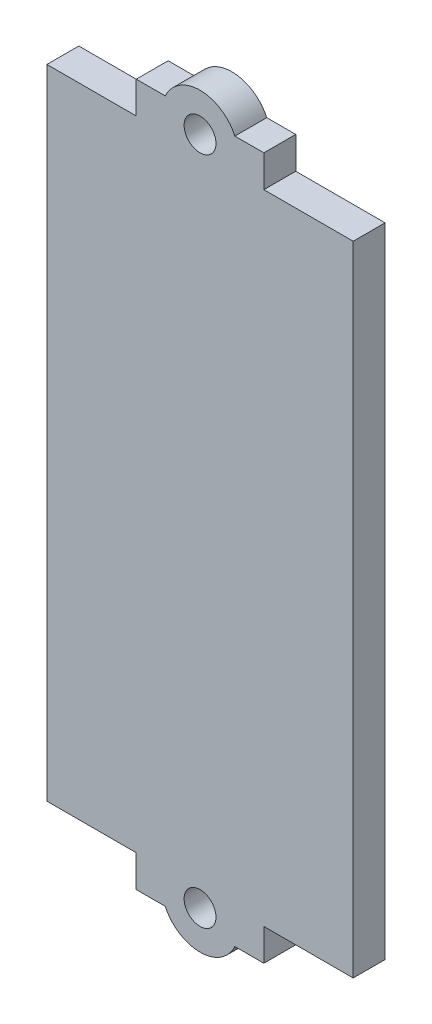
ISO-10303-21;
HEADER;
FILE_DESCRIPTION(('STEP AP214'),'2;1');
FILE_NAME('part.step','',(''),(''),'','','');
FILE_SCHEMA(('AUTOMOTIVE_DESIGN { 1 0 10303 214 1 1 1 1 }'));
ENDSEC;
DATA;
#1=APPLICATION_CONTEXT('core data for automotive mechanical design processes');
#2=APPLICATION_PROTOCOL_DEFINITION('international standard','automotive_design',2000,#1);
#3=PRODUCT_CONTEXT('',#1,'mechanical');
#4=PRODUCT('Part','Part','',(#3));
#5=PRODUCT_RELATED_PRODUCT_CATEGORY('part','',(#4));
#6=PRODUCT_DEFINITION_FORMATION('','',#4);
#7=PRODUCT_DEFINITION_CONTEXT('part definition',#1,'design');
#8=PRODUCT_DEFINITION('design','',#6,#7);
#9=PRODUCT_DEFINITION_SHAPE('','',#8);
#10=(LENGTH_UNIT() NAMED_UNIT(*) SI_UNIT(.MILLI.,.METRE.));
#11=(NAMED_UNIT(*) PLANE_ANGLE_UNIT() SI_UNIT($,.RADIAN.));
#12=(NAMED_UNIT(*) SI_UNIT($,.STERADIAN.) SOLID_ANGLE_UNIT());
#13=UNCERTAINTY_MEASURE_WITH_UNIT(LENGTH_MEASURE(1.E-05),#10,'distance_accuracy_value','');
#14=(GEOMETRIC_REPRESENTATION_CONTEXT(3) GLOBAL_UNCERTAINTY_ASSIGNED_CONTEXT((#13)) GLOBAL_UNIT_ASSIGNED_CONTEXT((#10,
#11,#12)) REPRESENTATION_CONTEXT('',''));
#15=CARTESIAN_POINT('',(0.,0.,0.));
#16=DIRECTION('',(0.,0.,1.));
#17=DIRECTION('',(1.,0.,0.));
#18=AXIS2_PLACEMENT_3D('',#15,#16,#17);
#19=CARTESIAN_POINT('',(0.,-55.,0.));
#20=DIRECTION('',(0.,1.,0.));
#21=DIRECTION('',(0.,0.,-1.));
#22=AXIS2_PLACEMENT_3D('',#19,#20,#21);
#23=PLANE('',#22);
#24=DIRECTION('',(0.,0.,1.));
#25=VECTOR('',#24,1.);
#26=CARTESIAN_POINT('',(-5.45435605731785,-55.,0.));
#27=LINE('',#26,#25);
#28=CARTESIAN_POINT('',(-5.45435605731785,-55.,5.));
#29=VERTEX_POINT('',#28);
#30=CARTESIAN_POINT('',(-5.45435605731785,-55.,0.));
#31=VERTEX_POINT('',#30);
#32=EDGE_CURVE('E11',#29,#31,#27,.F.);
#33=ORIENTED_EDGE('',*,*,#32,.F.);
#34=DIRECTION('',(1.,0.,0.));
#35=VECTOR('',#34,1.);
#36=CARTESIAN_POINT('',(-10.,-55.,5.));
#37=LINE('',#36,#35);
#38=CARTESIAN_POINT('',(-10.,-55.,5.));
#39=VERTEX_POINT('',#38);
#40=EDGE_CURVE('E155',#39,#29,#37,.T.);
#41=ORIENTED_EDGE('',*,*,#40,.F.);
#42=DIRECTION('',(0.,0.,1.));
#43=VECTOR('',#42,1.);
#44=CARTESIAN_POINT('',(-10.,-55.,5.));
#45=LINE('',#44,#43);
#46=CARTESIAN_POINT('',(-10.,-55.,0.));
#47=VERTEX_POINT('',#46);
#48=EDGE_CURVE('E176',#47,#39,#45,.T.);
#49=ORIENTED_EDGE('',*,*,#48,.F.);
#50=DIRECTION('',(-1.,0.,0.));
#51=VECTOR('',#50,1.);
#52=CARTESIAN_POINT('',(-10.,-55.,0.));
#53=LINE('',#52,#51);
#54=EDGE_CURVE('E156',#31,#47,#53,.T.);
#55=ORIENTED_EDGE('',*,*,#54,.F.);
#56=EDGE_LOOP('',(#33,#41,#49,#55));
#57=FACE_BOUND('',#56,.T.);
#58=ADVANCED_FACE('F33',(#57),#23,.F.);
#59=DIRECTION('',(0.,0.,1.));
#60=VECTOR('',#59,1.);
#61=CARTESIAN_POINT('',(5.45435605731786,-55.,0.));
#62=LINE('',#61,#60);
#63=CARTESIAN_POINT('',(5.45435605731786,-55.,0.));
#64=VERTEX_POINT('',#63);
#65=CARTESIAN_POINT('',(5.45435605731786,-55.,5.));
#66=VERTEX_POINT('',#65);
#67=EDGE_CURVE('E41',#64,#66,#62,.T.);
#68=ORIENTED_EDGE('',*,*,#67,.F.);
#69=CARTESIAN_POINT('',(9.99999999999999,-55.,0.));
#70=VERTEX_POINT('',#69);
#71=EDGE_CURVE('E271',#70,#64,#53,.T.);
#72=ORIENTED_EDGE('',*,*,#71,.F.);
#73=DIRECTION('',(0.,0.,-1.));
#74=VECTOR('',#73,1.);
#75=CARTESIAN_POINT('',(9.99999999999999,-55.,5.));
#76=LINE('',#75,#74);
#77=CARTESIAN_POINT('',(9.99999999999999,-55.,5.));
#78=VERTEX_POINT('',#77);
#79=EDGE_CURVE('E166',#78,#70,#76,.T.);
#80=ORIENTED_EDGE('',*,*,#79,.F.);
#81=EDGE_CURVE('E162',#66,#78,#37,.T.);
#82=ORIENTED_EDGE('',*,*,#81,.F.);
#83=EDGE_LOOP('',(#68,#72,#80,#82));
#84=FACE_BOUND('',#83,.T.);
#85=ADVANCED_FACE('F309',(#84),#23,.F.);
#86=CARTESIAN_POINT('',(0.,55.,0.));
#87=DIRECTION('',(0.,-1.,0.));
#88=DIRECTION('',(0.,0.,-1.));
#89=AXIS2_PLACEMENT_3D('',#86,#87,#88);
#90=PLANE('',#89);
#91=DIRECTION('',(-1.,0.,0.));
#92=VECTOR('',#91,1.);
#93=CARTESIAN_POINT('',(-10.,55.,0.));
#94=LINE('',#93,#92);
#95=CARTESIAN_POINT('',(9.99999999999999,55.,0.));
#96=VERTEX_POINT('',#95);
#97=CARTESIAN_POINT('',(5.45435605731786,55.,0.));
#98=VERTEX_POINT('',#97);
#99=EDGE_CURVE('E194',#96,#98,#94,.T.);
#100=ORIENTED_EDGE('',*,*,#99,.T.);
#101=DIRECTION('',(0.,0.,1.));
#102=VECTOR('',#101,1.);
#103=CARTESIAN_POINT('',(5.45435605731786,55.,0.));
#104=LINE('',#103,#102);
#105=CARTESIAN_POINT('',(5.45435605731786,55.,5.));
#106=VERTEX_POINT('',#105);
#107=EDGE_CURVE('E249',#98,#106,#104,.T.);
#108=ORIENTED_EDGE('',*,*,#107,.T.);
#109=DIRECTION('',(1.,0.,0.));
#110=VECTOR('',#109,1.);
#111=CARTESIAN_POINT('',(-10.,55.,5.));
#112=LINE('',#111,#110);
#113=CARTESIAN_POINT('',(9.99999999999999,55.,5.));
#114=VERTEX_POINT('',#113);
#115=EDGE_CURVE('E187',#106,#114,#112,.T.);
#116=ORIENTED_EDGE('',*,*,#115,.T.);
#117=DIRECTION('',(0.,0.,-1.));
#118=VECTOR('',#117,1.);
#119=CARTESIAN_POINT('',(9.99999999999999,55.,5.));
#120=LINE('',#119,#118);
#121=EDGE_CURVE('E191',#114,#96,#120,.T.);
#122=ORIENTED_EDGE('',*,*,#121,.T.);
#123=EDGE_LOOP('',(#100,#108,#116,#122));
#124=FACE_BOUND('',#123,.T.);
#125=ADVANCED_FACE('F254',(#124),#90,.F.);
#126=CARTESIAN_POINT('',(24.,-50.,5.));
#127=DIRECTION('',(0.,1.,0.));
#128=DIRECTION('',(0.,0.,1.));
#129=AXIS2_PLACEMENT_3D('',#126,#127,#128);
#130=PLANE('',#129);
#131=DIRECTION('',(1.,0.,0.));
#132=VECTOR('',#131,1.);
#133=CARTESIAN_POINT('',(24.,-50.,0.));
#134=LINE('',#133,#132);
#135=CARTESIAN_POINT('',(-24.,-50.,0.));
#136=VERTEX_POINT('',#135);
#137=CARTESIAN_POINT('',(-10.,-50.,0.));
#138=VERTEX_POINT('',#137);
#139=EDGE_CURVE('E230',#136,#138,#134,.T.);
#140=ORIENTED_EDGE('',*,*,#139,.T.);
#141=DIRECTION('',(0.,0.,1.));
#142=VECTOR('',#141,1.);
#143=CARTESIAN_POINT('',(-10.,-50.,5.));
#144=LINE('',#143,#142);
#145=CARTESIAN_POINT('',(-10.,-50.,5.));
#146=VERTEX_POINT('',#145);
#147=EDGE_CURVE('E170',#138,#146,#144,.T.);
#148=ORIENTED_EDGE('',*,*,#147,.T.);
#149=DIRECTION('',(1.,0.,0.));
#150=VECTOR('',#149,1.);
#151=CARTESIAN_POINT('',(24.,-50.,5.));
#152=LINE('',#151,#150);
#153=CARTESIAN_POINT('',(-24.,-50.,5.));
#154=VERTEX_POINT('',#153);
#155=EDGE_CURVE('E218',#154,#146,#152,.T.);
#156=ORIENTED_EDGE('',*,*,#155,.F.);
#157=DIRECTION('',(0.,0.,-1.));
#158=VECTOR('',#157,1.);
#159=CARTESIAN_POINT('',(-24.,-50.,5.));
#160=LINE('',#159,#158);
#161=EDGE_CURVE('E245',#154,#136,#160,.T.);
#162=ORIENTED_EDGE('',*,*,#161,.T.);
#163=EDGE_LOOP('',(#140,#148,#156,#162));
#164=FACE_BOUND('',#163,.T.);
#165=ADVANCED_FACE('F282',(#164),#130,.F.);
#166=CARTESIAN_POINT('',(24.,50.,5.));
#167=DIRECTION('',(0.,-1.,0.));
#168=DIRECTION('',(0.,0.,-1.));
#169=AXIS2_PLACEMENT_3D('',#166,#167,#168);
#170=PLANE('',#169);
#171=DIRECTION('',(0.,0.,1.));
#172=VECTOR('',#171,1.);
#173=CARTESIAN_POINT('',(-10.,50.,5.));
#174=LINE('',#173,#172);
#175=CARTESIAN_POINT('',(-10.,50.,0.));
#176=VERTEX_POINT('',#175);
#177=CARTESIAN_POINT('',(-10.,50.,5.));
#178=VERTEX_POINT('',#177);
#179=EDGE_CURVE('E183',#176,#178,#174,.T.);
#180=ORIENTED_EDGE('',*,*,#179,.F.);
#181=DIRECTION('',(-1.,0.,0.));
#182=VECTOR('',#181,1.);
#183=CARTESIAN_POINT('',(24.,50.,0.));
#184=LINE('',#183,#182);
#185=CARTESIAN_POINT('',(-24.,50.,0.));
#186=VERTEX_POINT('',#185);
#187=EDGE_CURVE('E235',#176,#186,#184,.T.);
#188=ORIENTED_EDGE('',*,*,#187,.T.);
#189=DIRECTION('',(0.,0.,-1.));
#190=VECTOR('',#189,1.);
#191=CARTESIAN_POINT('',(-24.,50.,5.));
#192=LINE('',#191,#190);
#193=CARTESIAN_POINT('',(-24.,50.,5.));
#194=VERTEX_POINT('',#193);
#195=EDGE_CURVE('E226',#194,#186,#192,.T.);
#196=ORIENTED_EDGE('',*,*,#195,.F.);
#197=DIRECTION('',(-1.,0.,0.));
#198=VECTOR('',#197,1.);
#199=CARTESIAN_POINT('',(24.,50.,5.));
#200=LINE('',#199,#198);
#201=EDGE_CURVE('E222',#178,#194,#200,.T.);
#202=ORIENTED_EDGE('',*,*,#201,.F.);
#203=EDGE_LOOP('',(#180,#188,#196,#202));
#204=FACE_BOUND('',#203,.T.);
#205=ADVANCED_FACE('F291',(#204),#170,.F.);
#206=DIRECTION('',(0.,0.,-1.));
#207=VECTOR('',#206,1.);
#208=CARTESIAN_POINT('',(9.99999999999999,50.,5.));
#209=LINE('',#208,#207);
#210=CARTESIAN_POINT('',(9.99999999999999,50.,5.));
#211=VERTEX_POINT('',#210);
#212=CARTESIAN_POINT('',(9.99999999999999,50.,0.));
#213=VERTEX_POINT('',#212);
#214=EDGE_CURVE('E188',#211,#213,#209,.T.);
#215=ORIENTED_EDGE('',*,*,#214,.F.);
#216=CARTESIAN_POINT('',(24.,50.,5.));
#217=VERTEX_POINT('',#216);
#218=EDGE_CURVE('E223',#217,#211,#200,.T.);
#219=ORIENTED_EDGE('',*,*,#218,.F.);
#220=DIRECTION('',(0.,0.,-1.));
#221=VECTOR('',#220,1.);
#222=CARTESIAN_POINT('',(24.,50.,5.));
#223=LINE('',#222,#221);
#224=CARTESIAN_POINT('',(24.,50.,0.));
#225=VERTEX_POINT('',#224);
#226=EDGE_CURVE('E239',#217,#225,#223,.T.);
#227=ORIENTED_EDGE('',*,*,#226,.T.);
#228=EDGE_CURVE('E217',#225,#213,#184,.T.);
#229=ORIENTED_EDGE('',*,*,#228,.T.);
#230=EDGE_LOOP('',(#215,#219,#227,#229));
#231=FACE_BOUND('',#230,.T.);
#232=ADVANCED_FACE('F341',(#231),#170,.F.);
#233=CARTESIAN_POINT('',(-24.,50.,5.));
#234=DIRECTION('',(1.,0.,0.));
#235=DIRECTION('',(0.,1.,0.));
#236=AXIS2_PLACEMENT_3D('',#233,#234,#235);
#237=PLANE('',#236);
#238=DIRECTION('',(0.,-1.,0.));
#239=VECTOR('',#238,1.);
#240=CARTESIAN_POINT('',(-24.,50.,0.));
#241=LINE('',#240,#239);
#242=EDGE_CURVE('E212',#186,#136,#241,.T.);
#243=ORIENTED_EDGE('',*,*,#242,.T.);
#244=ORIENTED_EDGE('',*,*,#161,.F.);
#245=DIRECTION('',(0.,-1.,0.));
#246=VECTOR('',#245,1.);
#247=CARTESIAN_POINT('',(-24.,50.,5.));
#248=LINE('',#247,#246);
#249=EDGE_CURVE('E213',#194,#154,#248,.T.);
#250=ORIENTED_EDGE('',*,*,#249,.F.);
#251=ORIENTED_EDGE('',*,*,#195,.T.);
#252=EDGE_LOOP('',(#243,#244,#250,#251));
#253=FACE_BOUND('',#252,.T.);
#254=ADVANCED_FACE('F35',(#253),#237,.F.);
#255=CARTESIAN_POINT('',(9.99999999999999,-50.,5.));
#256=VERTEX_POINT('',#255);
#257=CARTESIAN_POINT('',(24.,-50.,5.));
#258=VERTEX_POINT('',#257);
#259=EDGE_CURVE('E216',#256,#258,#152,.T.);
#260=ORIENTED_EDGE('',*,*,#259,.F.);
#261=DIRECTION('',(0.,0.,-1.));
#262=VECTOR('',#261,1.);
#263=CARTESIAN_POINT('',(9.99999999999999,-50.,5.));
#264=LINE('',#263,#262);
#265=CARTESIAN_POINT('',(9.99999999999999,-50.,0.));
#266=VERTEX_POINT('',#265);
#267=EDGE_CURVE('E173',#256,#266,#264,.T.);
#268=ORIENTED_EDGE('',*,*,#267,.T.);
#269=CARTESIAN_POINT('',(24.,-50.,0.));
#270=VERTEX_POINT('',#269);
#271=EDGE_CURVE('E229',#266,#270,#134,.T.);
#272=ORIENTED_EDGE('',*,*,#271,.T.);
#273=DIRECTION('',(0.,0.,-1.));
#274=VECTOR('',#273,1.);
#275=CARTESIAN_POINT('',(24.,-50.,5.));
#276=LINE('',#275,#274);
#277=EDGE_CURVE('E242',#258,#270,#276,.T.);
#278=ORIENTED_EDGE('',*,*,#277,.F.);
#279=EDGE_LOOP('',(#260,#268,#272,#278));
#280=FACE_BOUND('',#279,.T.);
#281=ADVANCED_FACE('F332',(#280),#130,.F.);
#282=CARTESIAN_POINT('',(24.,50.,5.));
#283=DIRECTION('',(-1.,0.,0.));
#284=DIRECTION('',(0.,-1.,0.));
#285=AXIS2_PLACEMENT_3D('',#282,#283,#284);
#286=PLANE('',#285);
#287=DIRECTION('',(0.,1.,0.));
#288=VECTOR('',#287,1.);
#289=CARTESIAN_POINT('',(24.,50.,0.));
#290=LINE('',#289,#288);
#291=EDGE_CURVE('E233',#270,#225,#290,.T.);
#292=ORIENTED_EDGE('',*,*,#291,.T.);
#293=ORIENTED_EDGE('',*,*,#226,.F.);
#294=DIRECTION('',(0.,1.,0.));
#295=VECTOR('',#294,1.);
#296=CARTESIAN_POINT('',(24.,50.,5.));
#297=LINE('',#296,#295);
#298=EDGE_CURVE('E220',#258,#217,#297,.T.);
#299=ORIENTED_EDGE('',*,*,#298,.F.);
#300=ORIENTED_EDGE('',*,*,#277,.T.);
#301=EDGE_LOOP('',(#292,#293,#299,#300));
#302=FACE_BOUND('',#301,.T.);
#303=ADVANCED_FACE('F337',(#302),#286,.F.);
#304=CARTESIAN_POINT('',(0.,0.,5.));
#305=DIRECTION('',(0.,0.,-1.));
#306=DIRECTION('',(-1.,0.,0.));
#307=AXIS2_PLACEMENT_3D('',#304,#305,#306);
#308=PLANE('',#307);
#309=CARTESIAN_POINT('',(0.,-52.5,5.));
#310=DIRECTION('',(0.,0.,-1.));
#311=DIRECTION('',(1.,0.,0.));
#312=AXIS2_PLACEMENT_3D('',#309,#310,#311);
#313=CIRCLE('',#312,2.5);
#314=CARTESIAN_POINT('',(2.50000000000001,-52.5,5.));
#315=VERTEX_POINT('',#314);
#316=EDGE_CURVE('E507',#315,#315,#313,.T.);
#317=ORIENTED_EDGE('',*,*,#316,.T.);
#318=EDGE_LOOP('',(#317));
#319=FACE_BOUND('',#318,.T.);
#320=ORIENTED_EDGE('',*,*,#40,.T.);
#321=CARTESIAN_POINT('',(0.,-52.5,5.));
#322=DIRECTION('',(0.,0.,-1.));
#323=DIRECTION('',(1.,0.,0.));
#324=AXIS2_PLACEMENT_3D('',#321,#322,#323);
#325=CIRCLE('',#324,6.);
#326=EDGE_CURVE('E48',#66,#29,#325,.T.);
#327=ORIENTED_EDGE('',*,*,#326,.F.);
#328=ORIENTED_EDGE('',*,*,#81,.T.);
#329=DIRECTION('',(0.,1.,0.));
#330=VECTOR('',#329,1.);
#331=CARTESIAN_POINT('',(9.99999999999999,-55.,5.));
#332=LINE('',#331,#330);
#333=EDGE_CURVE('E164',#78,#256,#332,.T.);
#334=ORIENTED_EDGE('',*,*,#333,.T.);
#335=ORIENTED_EDGE('',*,*,#259,.T.);
#336=ORIENTED_EDGE('',*,*,#298,.T.);
#337=ORIENTED_EDGE('',*,*,#218,.T.);
#338=DIRECTION('',(0.,-1.,0.));
#339=VECTOR('',#338,1.);
#340=CARTESIAN_POINT('',(9.99999999999999,55.,5.));
#341=LINE('',#340,#339);
#342=EDGE_CURVE('E206',#114,#211,#341,.T.);
#343=ORIENTED_EDGE('',*,*,#342,.F.);
#344=ORIENTED_EDGE('',*,*,#115,.F.);
#345=CARTESIAN_POINT('',(0.,52.5,5.));
#346=DIRECTION('',(0.,0.,1.));
#347=DIRECTION('',(1.,0.,0.));
#348=AXIS2_PLACEMENT_3D('',#345,#346,#347);
#349=CIRCLE('',#348,6.);
#350=CARTESIAN_POINT('',(-5.45435605731785,55.,5.));
#351=VERTEX_POINT('',#350);
#352=EDGE_CURVE('E261',#106,#351,#349,.T.);
#353=ORIENTED_EDGE('',*,*,#352,.T.);
#354=CARTESIAN_POINT('',(-10.,55.,5.));
#355=VERTEX_POINT('',#354);
#356=EDGE_CURVE('E189',#355,#351,#112,.T.);
#357=ORIENTED_EDGE('',*,*,#356,.F.);
#358=DIRECTION('',(0.,-1.,0.));
#359=VECTOR('',#358,1.);
#360=CARTESIAN_POINT('',(-10.,55.,5.));
#361=LINE('',#360,#359);
#362=EDGE_CURVE('E209',#355,#178,#361,.T.);
#363=ORIENTED_EDGE('',*,*,#362,.T.);
#364=ORIENTED_EDGE('',*,*,#201,.T.);
#365=ORIENTED_EDGE('',*,*,#249,.T.);
#366=ORIENTED_EDGE('',*,*,#155,.T.);
#367=DIRECTION('',(0.,1.,0.));
#368=VECTOR('',#367,1.);
#369=CARTESIAN_POINT('',(-10.,-55.,5.));
#370=LINE('',#369,#368);
#371=EDGE_CURVE('E160',#39,#146,#370,.T.);
#372=ORIENTED_EDGE('',*,*,#371,.F.);
#373=EDGE_LOOP('',(#320,#327,#328,#334,#335,#336,#337,#343,#344,#353,#357,#363,#364,#365,#366,#372));
#374=FACE_BOUND('',#373,.T.);
#375=CARTESIAN_POINT('',(0.,52.5,5.));
#376=DIRECTION('',(0.,0.,1.));
#377=DIRECTION('',(1.,0.,0.));
#378=AXIS2_PLACEMENT_3D('',#375,#376,#377);
#379=CIRCLE('',#378,2.5);
#380=CARTESIAN_POINT('',(2.50000000000001,52.5,5.));
#381=VERTEX_POINT('',#380);
#382=EDGE_CURVE('E267',#381,#381,#379,.T.);
#383=ORIENTED_EDGE('',*,*,#382,.F.);
#384=EDGE_LOOP('',(#383));
#385=FACE_BOUND('',#384,.T.);
#386=ADVANCED_FACE('F157',(#319,#374,#385),#308,.F.);
#387=CARTESIAN_POINT('',(0.,0.,0.));
#388=DIRECTION('',(0.,0.,-1.));
#389=DIRECTION('',(-1.,0.,0.));
#390=AXIS2_PLACEMENT_3D('',#387,#388,#389);
#391=PLANE('',#390);
#392=CARTESIAN_POINT('',(0.,-52.5,0.));
#393=DIRECTION('',(0.,0.,-1.));
#394=DIRECTION('',(1.,0.,0.));
#395=AXIS2_PLACEMENT_3D('',#392,#393,#394);
#396=CIRCLE('',#395,2.5);
#397=CARTESIAN_POINT('',(2.50000000000001,-52.5,0.));
#398=VERTEX_POINT('',#397);
#399=EDGE_CURVE('E149',#398,#398,#396,.T.);
#400=ORIENTED_EDGE('',*,*,#399,.F.);
#401=EDGE_LOOP('',(#400));
#402=FACE_BOUND('',#401,.T.);
#403=CARTESIAN_POINT('',(0.,52.5,0.));
#404=DIRECTION('',(0.,0.,1.));
#405=DIRECTION('',(1.,0.,0.));
#406=AXIS2_PLACEMENT_3D('',#403,#404,#405);
#407=CIRCLE('',#406,2.5);
#408=CARTESIAN_POINT('',(2.50000000000001,52.5,0.));
#409=VERTEX_POINT('',#408);
#410=EDGE_CURVE('E263',#409,#409,#407,.T.);
#411=ORIENTED_EDGE('',*,*,#410,.T.);
#412=EDGE_LOOP('',(#411));
#413=FACE_BOUND('',#412,.T.);
#414=ORIENTED_EDGE('',*,*,#71,.T.);
#415=CARTESIAN_POINT('',(0.,-52.5,0.));
#416=DIRECTION('',(0.,0.,-1.));
#417=DIRECTION('',(1.,0.,0.));
#418=AXIS2_PLACEMENT_3D('',#415,#416,#417);
#419=CIRCLE('',#418,6.);
#420=EDGE_CURVE('E148',#64,#31,#419,.T.);
#421=ORIENTED_EDGE('',*,*,#420,.T.);
#422=ORIENTED_EDGE('',*,*,#54,.T.);
#423=DIRECTION('',(0.,1.,0.));
#424=VECTOR('',#423,1.);
#425=CARTESIAN_POINT('',(-10.,-55.,0.));
#426=LINE('',#425,#424);
#427=EDGE_CURVE('E181',#47,#138,#426,.T.);
#428=ORIENTED_EDGE('',*,*,#427,.T.);
#429=ORIENTED_EDGE('',*,*,#139,.F.);
#430=ORIENTED_EDGE('',*,*,#242,.F.);
#431=ORIENTED_EDGE('',*,*,#187,.F.);
#432=DIRECTION('',(0.,-1.,0.));
#433=VECTOR('',#432,1.);
#434=CARTESIAN_POINT('',(-10.,55.,0.));
#435=LINE('',#434,#433);
#436=CARTESIAN_POINT('',(-10.,55.,0.));
#437=VERTEX_POINT('',#436);
#438=EDGE_CURVE('E196',#437,#176,#435,.T.);
#439=ORIENTED_EDGE('',*,*,#438,.F.);
#440=CARTESIAN_POINT('',(-5.45435605731785,55.,0.));
#441=VERTEX_POINT('',#440);
#442=EDGE_CURVE('E193',#441,#437,#94,.T.);
#443=ORIENTED_EDGE('',*,*,#442,.F.);
#444=CARTESIAN_POINT('',(0.,52.5,0.));
#445=DIRECTION('',(0.,0.,1.));
#446=DIRECTION('',(1.,0.,0.));
#447=AXIS2_PLACEMENT_3D('',#444,#445,#446);
#448=CIRCLE('',#447,6.);
#449=EDGE_CURVE('E174',#98,#441,#448,.T.);
#450=ORIENTED_EDGE('',*,*,#449,.F.);
#451=ORIENTED_EDGE('',*,*,#99,.F.);
#452=DIRECTION('',(0.,-1.,0.));
#453=VECTOR('',#452,1.);
#454=CARTESIAN_POINT('',(9.99999999999999,55.,0.));
#455=LINE('',#454,#453);
#456=EDGE_CURVE('E203',#96,#213,#455,.T.);
#457=ORIENTED_EDGE('',*,*,#456,.T.);
#458=ORIENTED_EDGE('',*,*,#228,.F.);
#459=ORIENTED_EDGE('',*,*,#291,.F.);
#460=ORIENTED_EDGE('',*,*,#271,.F.);
#461=DIRECTION('',(0.,1.,0.));
#462=VECTOR('',#461,1.);
#463=CARTESIAN_POINT('',(9.99999999999999,-55.,0.));
#464=LINE('',#463,#462);
#465=EDGE_CURVE('E179',#70,#266,#464,.T.);
#466=ORIENTED_EDGE('',*,*,#465,.F.);
#467=EDGE_LOOP('',(#414,#421,#422,#428,#429,#430,#431,#439,#443,#450,#451,#457,#458,#459,#460,#466));
#468=FACE_BOUND('',#467,.T.);
#469=ADVANCED_FACE('F277',(#402,#413,#468),#391,.T.);
#470=CARTESIAN_POINT('',(-10.,55.,5.));
#471=DIRECTION('',(1.,0.,0.));
#472=DIRECTION('',(0.,0.,-1.));
#473=AXIS2_PLACEMENT_3D('',#470,#471,#472);
#474=PLANE('',#473);
#475=ORIENTED_EDGE('',*,*,#179,.T.);
#476=ORIENTED_EDGE('',*,*,#362,.F.);
#477=DIRECTION('',(0.,0.,1.));
#478=VECTOR('',#477,1.);
#479=CARTESIAN_POINT('',(-10.,55.,5.));
#480=LINE('',#479,#478);
#481=EDGE_CURVE('E184',#437,#355,#480,.T.);
#482=ORIENTED_EDGE('',*,*,#481,.F.);
#483=ORIENTED_EDGE('',*,*,#438,.T.);
#484=EDGE_LOOP('',(#475,#476,#482,#483));
#485=FACE_BOUND('',#484,.T.);
#486=ADVANCED_FACE('F294',(#485),#474,.F.);
#487=CARTESIAN_POINT('',(9.99999999999999,55.,5.));
#488=DIRECTION('',(-1.,0.,0.));
#489=DIRECTION('',(0.,0.,1.));
#490=AXIS2_PLACEMENT_3D('',#487,#488,#489);
#491=PLANE('',#490);
#492=ORIENTED_EDGE('',*,*,#214,.T.);
#493=ORIENTED_EDGE('',*,*,#456,.F.);
#494=ORIENTED_EDGE('',*,*,#121,.F.);
#495=ORIENTED_EDGE('',*,*,#342,.T.);
#496=EDGE_LOOP('',(#492,#493,#494,#495));
#497=FACE_BOUND('',#496,.T.);
#498=ADVANCED_FACE('F298',(#497),#491,.F.);
#499=ORIENTED_EDGE('',*,*,#356,.T.);
#500=DIRECTION('',(0.,0.,1.));
#501=VECTOR('',#500,1.);
#502=CARTESIAN_POINT('',(-5.45435605731785,55.,0.));
#503=LINE('',#502,#501);
#504=EDGE_CURVE('E56',#351,#441,#503,.F.);
#505=ORIENTED_EDGE('',*,*,#504,.T.);
#506=ORIENTED_EDGE('',*,*,#442,.T.);
#507=ORIENTED_EDGE('',*,*,#481,.T.);
#508=EDGE_LOOP('',(#499,#505,#506,#507));
#509=FACE_BOUND('',#508,.T.);
#510=ADVANCED_FACE('F296',(#509),#90,.F.);
#511=CARTESIAN_POINT('',(-10.,-55.,5.));
#512=DIRECTION('',(-1.,0.,0.));
#513=DIRECTION('',(0.,0.,1.));
#514=AXIS2_PLACEMENT_3D('',#511,#512,#513);
#515=PLANE('',#514);
#516=ORIENTED_EDGE('',*,*,#147,.F.);
#517=ORIENTED_EDGE('',*,*,#427,.F.);
#518=ORIENTED_EDGE('',*,*,#48,.T.);
#519=ORIENTED_EDGE('',*,*,#371,.T.);
#520=EDGE_LOOP('',(#516,#517,#518,#519));
#521=FACE_BOUND('',#520,.T.);
#522=ADVANCED_FACE('F280',(#521),#515,.T.);
#523=CARTESIAN_POINT('',(9.99999999999999,-55.,5.));
#524=DIRECTION('',(1.,0.,0.));
#525=DIRECTION('',(0.,0.,-1.));
#526=AXIS2_PLACEMENT_3D('',#523,#524,#525);
#527=PLANE('',#526);
#528=ORIENTED_EDGE('',*,*,#267,.F.);
#529=ORIENTED_EDGE('',*,*,#333,.F.);
#530=ORIENTED_EDGE('',*,*,#79,.T.);
#531=ORIENTED_EDGE('',*,*,#465,.T.);
#532=EDGE_LOOP('',(#528,#529,#530,#531));
#533=FACE_BOUND('',#532,.T.);
#534=ADVANCED_FACE('F304',(#533),#527,.T.);
#535=CARTESIAN_POINT('',(0.,52.5,0.));
#536=DIRECTION('',(0.,0.,1.));
#537=DIRECTION('',(1.,0.,0.));
#538=AXIS2_PLACEMENT_3D('',#535,#536,#537);
#539=CYLINDRICAL_SURFACE('',#538,6.);
#540=ORIENTED_EDGE('',*,*,#107,.F.);
#541=ORIENTED_EDGE('',*,*,#449,.T.);
#542=ORIENTED_EDGE('',*,*,#504,.F.);
#543=ORIENTED_EDGE('',*,*,#352,.F.);
#544=EDGE_LOOP('',(#540,#541,#542,#543));
#545=FACE_BOUND('',#544,.T.);
#546=ADVANCED_FACE('F262',(#545),#539,.T.);
#547=CARTESIAN_POINT('',(0.,52.5,0.));
#548=DIRECTION('',(0.,0.,1.));
#549=DIRECTION('',(1.,0.,0.));
#550=AXIS2_PLACEMENT_3D('',#547,#548,#549);
#551=CYLINDRICAL_SURFACE('',#550,2.5);
#552=ORIENTED_EDGE('',*,*,#410,.F.);
#553=EDGE_LOOP('',(#552));
#554=FACE_BOUND('',#553,.T.);
#555=ORIENTED_EDGE('',*,*,#382,.T.);
#556=EDGE_LOOP('',(#555));
#557=FACE_BOUND('',#556,.T.);
#558=ADVANCED_FACE('F324',(#554,#557),#551,.F.);
#559=CARTESIAN_POINT('',(0.,-52.5,0.));
#560=DIRECTION('',(0.,0.,1.));
#561=DIRECTION('',(1.,0.,0.));
#562=AXIS2_PLACEMENT_3D('',#559,#560,#561);
#563=CYLINDRICAL_SURFACE('',#562,6.);
#564=ORIENTED_EDGE('',*,*,#326,.T.);
#565=ORIENTED_EDGE('',*,*,#32,.T.);
#566=ORIENTED_EDGE('',*,*,#420,.F.);
#567=ORIENTED_EDGE('',*,*,#67,.T.);
#568=EDGE_LOOP('',(#564,#565,#566,#567));
#569=FACE_BOUND('',#568,.T.);
#570=ADVANCED_FACE('F144',(#569),#563,.T.);
#571=CARTESIAN_POINT('',(0.,-52.5,0.));
#572=DIRECTION('',(0.,0.,1.));
#573=DIRECTION('',(1.,0.,0.));
#574=AXIS2_PLACEMENT_3D('',#571,#572,#573);
#575=CYLINDRICAL_SURFACE('',#574,2.5);
#576=ORIENTED_EDGE('',*,*,#399,.T.);
#577=EDGE_LOOP('',(#576));
#578=FACE_BOUND('',#577,.T.);
#579=ORIENTED_EDGE('',*,*,#316,.F.);
#580=EDGE_LOOP('',(#579));
#581=FACE_BOUND('',#580,.T.);
#582=ADVANCED_FACE('F489',(#578,#581),#575,.F.);
#583=CLOSED_SHELL('',(#58,#85,#125,#165,#205,#232,#254,#281,#303,#386,#469,#486,#498,#510,#522,
#534,#546,#558,#570,#582));
#584=MANIFOLD_SOLID_BREP('B2',#583);
#585=ADVANCED_BREP_SHAPE_REPRESENTATION('',(#18,#584),#14);
#586=SHAPE_DEFINITION_REPRESENTATION(#9,#585);
ENDSEC;
END-ISO-10303-21;
